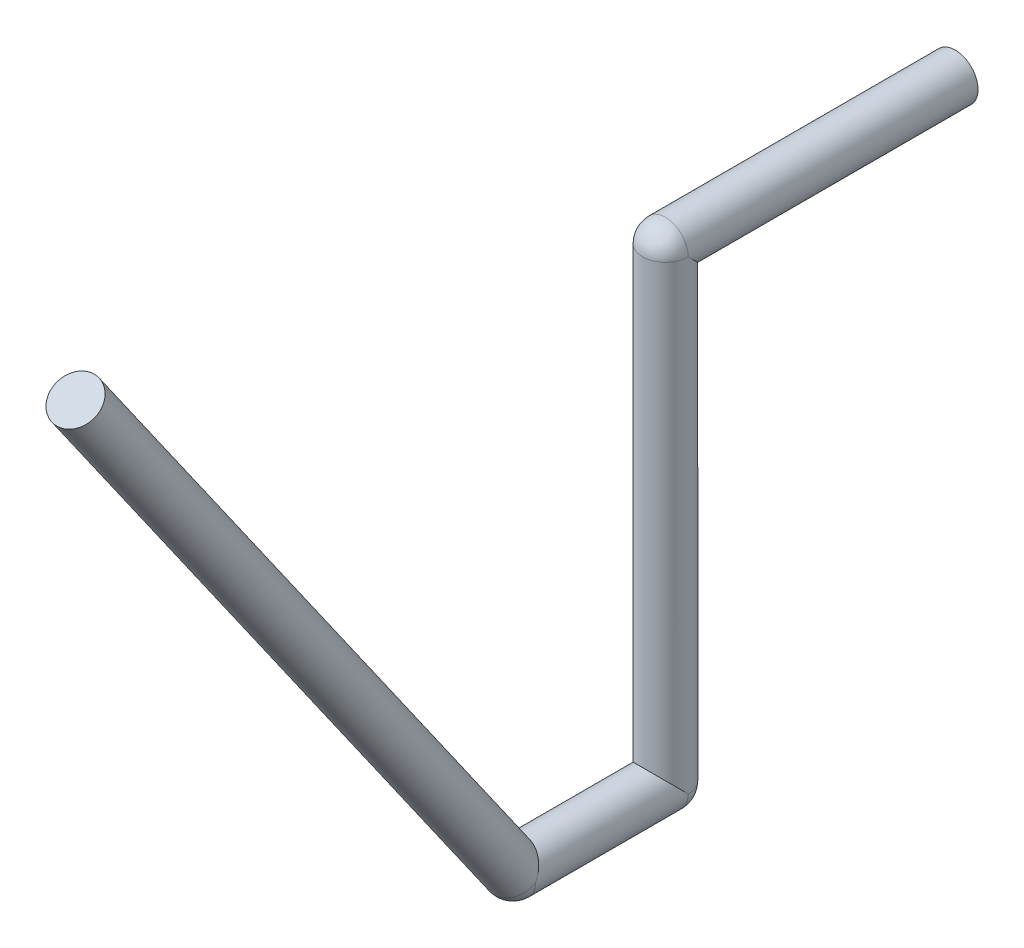
ISO-10303-21;
HEADER;
FILE_DESCRIPTION(('STEP AP214'),'2;1');
FILE_NAME('part.step','',(''),(''),'','','');
FILE_SCHEMA(('AUTOMOTIVE_DESIGN { 1 0 10303 214 1 1 1 1 }'));
ENDSEC;
DATA;
#1=APPLICATION_CONTEXT('core data for automotive mechanical design processes');
#2=APPLICATION_PROTOCOL_DEFINITION('international standard','automotive_design',2000,#1);
#3=PRODUCT_CONTEXT('',#1,'mechanical');
#4=PRODUCT('Part','Part','',(#3));
#5=PRODUCT_RELATED_PRODUCT_CATEGORY('part','',(#4));
#6=PRODUCT_DEFINITION_FORMATION('','',#4);
#7=PRODUCT_DEFINITION_CONTEXT('part definition',#1,'design');
#8=PRODUCT_DEFINITION('design','',#6,#7);
#9=PRODUCT_DEFINITION_SHAPE('','',#8);
#10=(LENGTH_UNIT() NAMED_UNIT(*) SI_UNIT(.MILLI.,.METRE.));
#11=(NAMED_UNIT(*) PLANE_ANGLE_UNIT() SI_UNIT($,.RADIAN.));
#12=(NAMED_UNIT(*) SI_UNIT($,.STERADIAN.) SOLID_ANGLE_UNIT());
#13=UNCERTAINTY_MEASURE_WITH_UNIT(LENGTH_MEASURE(1.E-05),#10,'distance_accuracy_value','');
#14=(GEOMETRIC_REPRESENTATION_CONTEXT(3) GLOBAL_UNCERTAINTY_ASSIGNED_CONTEXT((#13)) GLOBAL_UNIT_ASSIGNED_CONTEXT((#10,
#11,#12)) REPRESENTATION_CONTEXT('',''));
#15=CARTESIAN_POINT('',(0.,0.,0.));
#16=DIRECTION('',(0.,0.,1.));
#17=DIRECTION('',(1.,0.,0.));
#18=AXIS2_PLACEMENT_3D('',#15,#16,#17);
#19=CARTESIAN_POINT('',(0.6,10.4,-2.5));
#20=DIRECTION('',(0.,0.,1.));
#21=DIRECTION('',(1.,0.,0.));
#22=AXIS2_PLACEMENT_3D('',#19,#20,#21);
#23=PLANE('',#22);
#24=CARTESIAN_POINT('',(0.6,10.4,-2.5));
#25=DIRECTION('',(0.,0.,1.));
#26=DIRECTION('',(1.,0.,0.));
#27=AXIS2_PLACEMENT_3D('',#24,#25,#26);
#28=CIRCLE('',#27,0.3);
#29=CARTESIAN_POINT('',(0.3,10.4,-2.5));
#30=VERTEX_POINT('',#29);
#31=EDGE_CURVE('E11',#30,#30,#28,.T.);
#32=ORIENTED_EDGE('',*,*,#31,.F.);
#33=EDGE_LOOP('',(#32));
#34=FACE_BOUND('',#33,.T.);
#35=ADVANCED_FACE('F17',(#34),#23,.F.);
#36=CARTESIAN_POINT('',(0.6,10.4,-2.5));
#37=DIRECTION('',(0.,0.,1.));
#38=DIRECTION('',(1.,0.,0.));
#39=AXIS2_PLACEMENT_3D('',#36,#37,#38);
#40=CYLINDRICAL_SURFACE('',#39,0.3);
#41=CARTESIAN_POINT('',(0.6,10.4,1.3));
#42=DIRECTION('',(0.,-0.707106781186548,0.707106781186548));
#43=DIRECTION('',(0.,0.707106781186548,0.707106781186548));
#44=AXIS2_PLACEMENT_3D('',#41,#42,#43);
#45=ELLIPSE('',#44,0.424264068712,0.3);
#46=CARTESIAN_POINT('',(0.3,10.4,1.3));
#47=VERTEX_POINT('',#46);
#48=CARTESIAN_POINT('',(0.9,10.4,1.3));
#49=VERTEX_POINT('',#48);
#50=EDGE_CURVE('E93',#47,#49,#45,.T.);
#51=ORIENTED_EDGE('',*,*,#50,.F.);
#52=DIRECTION('',(0.,0.,-1.));
#53=VECTOR('',#52,1.);
#54=CARTESIAN_POINT('',(0.3,10.4,-2.5));
#55=LINE('',#54,#53);
#56=EDGE_CURVE('E28',#47,#30,#55,.T.);
#57=ORIENTED_EDGE('',*,*,#56,.T.);
#58=ORIENTED_EDGE('',*,*,#31,.T.);
#59=ORIENTED_EDGE('',*,*,#56,.F.);
#60=CARTESIAN_POINT('',(0.6,10.4,1.3));
#61=DIRECTION('',(0.,0.,1.));
#62=DIRECTION('',(1.,0.,0.));
#63=AXIS2_PLACEMENT_3D('',#60,#61,#62);
#64=CIRCLE('',#63,0.3);
#65=CARTESIAN_POINT('',(0.868328157299975,10.53416407865,1.3));
#66=VERTEX_POINT('',#65);
#67=EDGE_CURVE('E96',#66,#47,#64,.T.);
#68=ORIENTED_EDGE('',*,*,#67,.F.);
#69=CARTESIAN_POINT('',(0.6,10.4,1.3));
#70=DIRECTION('',(0.,0.,1.));
#71=DIRECTION('',(1.,0.,0.));
#72=AXIS2_PLACEMENT_3D('',#69,#70,#71);
#73=CIRCLE('',#72,0.3);
#74=EDGE_CURVE('E89',#49,#66,#73,.T.);
#75=ORIENTED_EDGE('',*,*,#74,.F.);
#76=EDGE_LOOP('',(#51,#57,#58,#59,#68,#75));
#77=FACE_BOUND('',#76,.T.);
#78=ADVANCED_FACE('F91',(#77),#40,.T.);
#79=CARTESIAN_POINT('',(0.6,10.4,1.3));
#80=DIRECTION('',(0.577350269189625,0.577350269189628,0.577350269189625));
#81=DIRECTION('',(-0.707106781186548,0.,0.707106781186548));
#82=AXIS2_PLACEMENT_3D('',#79,#80,#81);
#83=SPHERICAL_SURFACE('',#82,0.3);
#84=CARTESIAN_POINT('',(0.6,10.4,1.3));
#85=DIRECTION('',(0.,-1.,0.));
#86=DIRECTION('',(1.,0.,0.));
#87=AXIS2_PLACEMENT_3D('',#84,#85,#86);
#88=CIRCLE('',#87,0.3);
#89=EDGE_CURVE('E101',#49,#47,#88,.T.);
#90=ORIENTED_EDGE('',*,*,#89,.F.);
#91=ORIENTED_EDGE('',*,*,#74,.T.);
#92=CARTESIAN_POINT('',(0.6,10.4,1.3));
#93=DIRECTION('',(-0.408248290463863,0.816496580927726,-0.408248290463863));
#94=DIRECTION('',(0.707106781186548,0.,-0.707106781186548));
#95=AXIS2_PLACEMENT_3D('',#92,#93,#94);
#96=CIRCLE('',#95,0.3);
#97=CARTESIAN_POINT('',(0.773205080756888,10.5732050807569,1.47320508075689));
#98=VERTEX_POINT('',#97);
#99=EDGE_CURVE('E100',#98,#66,#96,.T.);
#100=ORIENTED_EDGE('',*,*,#99,.F.);
#101=ORIENTED_EDGE('',*,*,#99,.T.);
#102=ORIENTED_EDGE('',*,*,#67,.T.);
#103=EDGE_LOOP('',(#90,#91,#100,#101,#102));
#104=FACE_BOUND('',#103,.T.);
#105=ADVANCED_FACE('F19',(#104),#83,.T.);
#106=CARTESIAN_POINT('',(0.6,10.4,1.3));
#107=DIRECTION('',(0.,-1.,0.));
#108=DIRECTION('',(1.,0.,0.));
#109=AXIS2_PLACEMENT_3D('',#106,#107,#108);
#110=CYLINDRICAL_SURFACE('',#109,0.3);
#111=CARTESIAN_POINT('',(0.6,4.3,1.3));
#112=DIRECTION('',(0.,-1.,0.));
#113=DIRECTION('',(1.,0.,0.));
#114=AXIS2_PLACEMENT_3D('',#111,#112,#113);
#115=CIRCLE('',#114,0.3);
#116=CARTESIAN_POINT('',(0.3,4.3,1.3));
#117=VERTEX_POINT('',#116);
#118=CARTESIAN_POINT('',(0.812132034355964,4.3,1.08786796564404));
#119=VERTEX_POINT('',#118);
#120=EDGE_CURVE('E124',#117,#119,#115,.T.);
#121=ORIENTED_EDGE('',*,*,#120,.F.);
#122=DIRECTION('',(0.,1.,0.));
#123=VECTOR('',#122,1.);
#124=CARTESIAN_POINT('',(0.3,10.4,1.3));
#125=LINE('',#124,#123);
#126=EDGE_CURVE('E107',#117,#47,#125,.T.);
#127=ORIENTED_EDGE('',*,*,#126,.T.);
#128=ORIENTED_EDGE('',*,*,#50,.T.);
#129=ORIENTED_EDGE('',*,*,#89,.T.);
#130=ORIENTED_EDGE('',*,*,#126,.F.);
#131=CARTESIAN_POINT('',(0.6,4.3,1.3));
#132=DIRECTION('',(0.,-0.707106781186548,0.707106781186548));
#133=DIRECTION('',(0.,-0.707106781186548,-0.707106781186548));
#134=AXIS2_PLACEMENT_3D('',#131,#132,#133);
#135=ELLIPSE('',#134,0.424264068712,0.3);
#136=CARTESIAN_POINT('',(0.9,4.3,1.3));
#137=VERTEX_POINT('',#136);
#138=EDGE_CURVE('E129',#137,#117,#135,.T.);
#139=ORIENTED_EDGE('',*,*,#138,.F.);
#140=CARTESIAN_POINT('',(0.6,4.3,1.3));
#141=DIRECTION('',(0.,-1.,0.));
#142=DIRECTION('',(1.,0.,0.));
#143=AXIS2_PLACEMENT_3D('',#140,#141,#142);
#144=CIRCLE('',#143,0.3);
#145=EDGE_CURVE('E58',#119,#137,#144,.T.);
#146=ORIENTED_EDGE('',*,*,#145,.F.);
#147=EDGE_LOOP('',(#121,#127,#128,#129,#130,#139,#146));
#148=FACE_BOUND('',#147,.T.);
#149=ADVANCED_FACE('F106',(#148),#110,.T.);
#150=CARTESIAN_POINT('',(0.6,4.3,1.3));
#151=DIRECTION('',(0.577350269189626,0.577350269189626,0.577350269189626));
#152=DIRECTION('',(-0.707106781186548,0.,0.707106781186548));
#153=AXIS2_PLACEMENT_3D('',#150,#151,#152);
#154=SPHERICAL_SURFACE('',#153,0.3);
#155=ORIENTED_EDGE('',*,*,#120,.T.);
#156=CARTESIAN_POINT('',(0.6,4.3,1.3));
#157=DIRECTION('',(-0.408248290463863,0.816496580927726,-0.408248290463863));
#158=DIRECTION('',(0.707106781186548,0.,-0.707106781186548));
#159=AXIS2_PLACEMENT_3D('',#156,#157,#158);
#160=CIRCLE('',#159,0.3);
#161=CARTESIAN_POINT('',(0.426794919243112,4.12679491924311,1.12679491924311));
#162=VERTEX_POINT('',#161);
#163=EDGE_CURVE('E128',#119,#162,#160,.T.);
#164=ORIENTED_EDGE('',*,*,#163,.T.);
#165=ORIENTED_EDGE('',*,*,#163,.F.);
#166=ORIENTED_EDGE('',*,*,#145,.T.);
#167=CARTESIAN_POINT('',(0.6,4.3,1.3));
#168=DIRECTION('',(0.,0.,1.));
#169=DIRECTION('',(1.,0.,0.));
#170=AXIS2_PLACEMENT_3D('',#167,#168,#169);
#171=CIRCLE('',#170,0.3);
#172=EDGE_CURVE('E134',#117,#137,#171,.T.);
#173=ORIENTED_EDGE('',*,*,#172,.F.);
#174=EDGE_LOOP('',(#155,#164,#165,#166,#173));
#175=FACE_BOUND('',#174,.T.);
#176=ADVANCED_FACE('F162',(#175),#154,.T.);
#177=CARTESIAN_POINT('',(0.6,4.3,1.3));
#178=DIRECTION('',(0.,0.,1.));
#179=DIRECTION('',(1.,0.,0.));
#180=AXIS2_PLACEMENT_3D('',#177,#178,#179);
#181=CYLINDRICAL_SURFACE('',#180,0.3);
#182=CARTESIAN_POINT('',(0.6,4.3,3.3));
#183=DIRECTION('',(0.,0.,1.));
#184=DIRECTION('',(1.,0.,0.));
#185=AXIS2_PLACEMENT_3D('',#182,#183,#184);
#186=CIRCLE('',#185,0.3);
#187=CARTESIAN_POINT('',(0.3,4.3,3.3));
#188=VERTEX_POINT('',#187);
#189=CARTESIAN_POINT('',(0.9,4.3,3.3));
#190=VERTEX_POINT('',#189);
#191=EDGE_CURVE('E21',#188,#190,#186,.T.);
#192=ORIENTED_EDGE('',*,*,#191,.F.);
#193=DIRECTION('',(0.,0.,-1.));
#194=VECTOR('',#193,1.);
#195=CARTESIAN_POINT('',(0.3,4.3,1.3));
#196=LINE('',#195,#194);
#197=EDGE_CURVE('E130',#188,#117,#196,.T.);
#198=ORIENTED_EDGE('',*,*,#197,.T.);
#199=ORIENTED_EDGE('',*,*,#172,.T.);
#200=ORIENTED_EDGE('',*,*,#138,.T.);
#201=ORIENTED_EDGE('',*,*,#197,.F.);
#202=CARTESIAN_POINT('',(0.6,4.3,3.3));
#203=DIRECTION('',(0.,0.461748613235098,0.887010833178188));
#204=DIRECTION('',(0.,-0.887010833178188,0.461748613235098));
#205=AXIS2_PLACEMENT_3D('',#202,#203,#204);
#206=ELLIPSE('',#205,0.33821458406,0.3);
#207=EDGE_CURVE('E119',#190,#188,#206,.T.);
#208=ORIENTED_EDGE('',*,*,#207,.F.);
#209=EDGE_LOOP('',(#192,#198,#199,#200,#201,#208));
#210=FACE_BOUND('',#209,.T.);
#211=ADVANCED_FACE('F160',(#210),#181,.T.);
#212=CARTESIAN_POINT('',(0.6,4.3,3.3));
#213=DIRECTION('',(0.,0.,1.));
#214=DIRECTION('',(1.,0.,0.));
#215=AXIS2_PLACEMENT_3D('',#212,#213,#214);
#216=SPHERICAL_SURFACE('',#215,0.3);
#217=ORIENTED_EDGE('',*,*,#191,.T.);
#218=CARTESIAN_POINT('',(0.6,4.3,3.3));
#219=DIRECTION('',(0.,0.819152044289016,0.573576436351011));
#220=DIRECTION('',(1.,0.,0.));
#221=AXIS2_PLACEMENT_3D('',#218,#219,#220);
#222=CIRCLE('',#221,0.3);
#223=EDGE_CURVE('E123',#188,#190,#222,.T.);
#224=ORIENTED_EDGE('',*,*,#223,.F.);
#225=EDGE_LOOP('',(#217,#224));
#226=FACE_BOUND('',#225,.T.);
#227=ADVANCED_FACE('F171',(#226),#216,.T.);
#228=CARTESIAN_POINT('',(0.6,4.3,3.3));
#229=DIRECTION('',(0.,0.819152044289016,0.573576436351011));
#230=DIRECTION('',(1.,0.,0.));
#231=AXIS2_PLACEMENT_3D('',#228,#229,#230);
#232=CYLINDRICAL_SURFACE('',#231,0.3);
#233=CARTESIAN_POINT('',(0.6,12.49152044289,9.03576436351));
#234=DIRECTION('',(0.,0.819152044289016,0.573576436351011));
#235=DIRECTION('',(1.,0.,0.));
#236=AXIS2_PLACEMENT_3D('',#233,#234,#235);
#237=CIRCLE('',#236,0.3);
#238=CARTESIAN_POINT('',(0.3,12.49152044289,9.03576436351));
#239=VERTEX_POINT('',#238);
#240=EDGE_CURVE('E150',#239,#239,#237,.T.);
#241=ORIENTED_EDGE('',*,*,#240,.F.);
#242=DIRECTION('',(0.,-0.819152044289016,-0.573576436351011));
#243=VECTOR('',#242,1.);
#244=CARTESIAN_POINT('',(0.3,4.3,3.3));
#245=LINE('',#244,#243);
#246=EDGE_CURVE('E144',#239,#188,#245,.T.);
#247=ORIENTED_EDGE('',*,*,#246,.T.);
#248=ORIENTED_EDGE('',*,*,#223,.T.);
#249=ORIENTED_EDGE('',*,*,#207,.T.);
#250=ORIENTED_EDGE('',*,*,#246,.F.);
#251=EDGE_LOOP('',(#241,#247,#248,#249,#250));
#252=FACE_BOUND('',#251,.T.);
#253=ADVANCED_FACE('F169',(#252),#232,.T.);
#254=CARTESIAN_POINT('',(0.6,12.49152044289,9.03576436351));
#255=DIRECTION('',(0.,0.819152044289016,0.573576436351011));
#256=DIRECTION('',(1.,0.,0.));
#257=AXIS2_PLACEMENT_3D('',#254,#255,#256);
#258=PLANE('',#257);
#259=ORIENTED_EDGE('',*,*,#240,.T.);
#260=EDGE_LOOP('',(#259));
#261=FACE_BOUND('',#260,.T.);
#262=ADVANCED_FACE('F197',(#261),#258,.T.);
#263=CLOSED_SHELL('',(#35,#78,#105,#149,#176,#211,#227,#253,#262));
#264=MANIFOLD_SOLID_BREP('B1',#263);
#265=ADVANCED_BREP_SHAPE_REPRESENTATION('',(#18,#264),#14);
#266=SHAPE_DEFINITION_REPRESENTATION(#9,#265);
ENDSEC;
END-ISO-10303-21;
